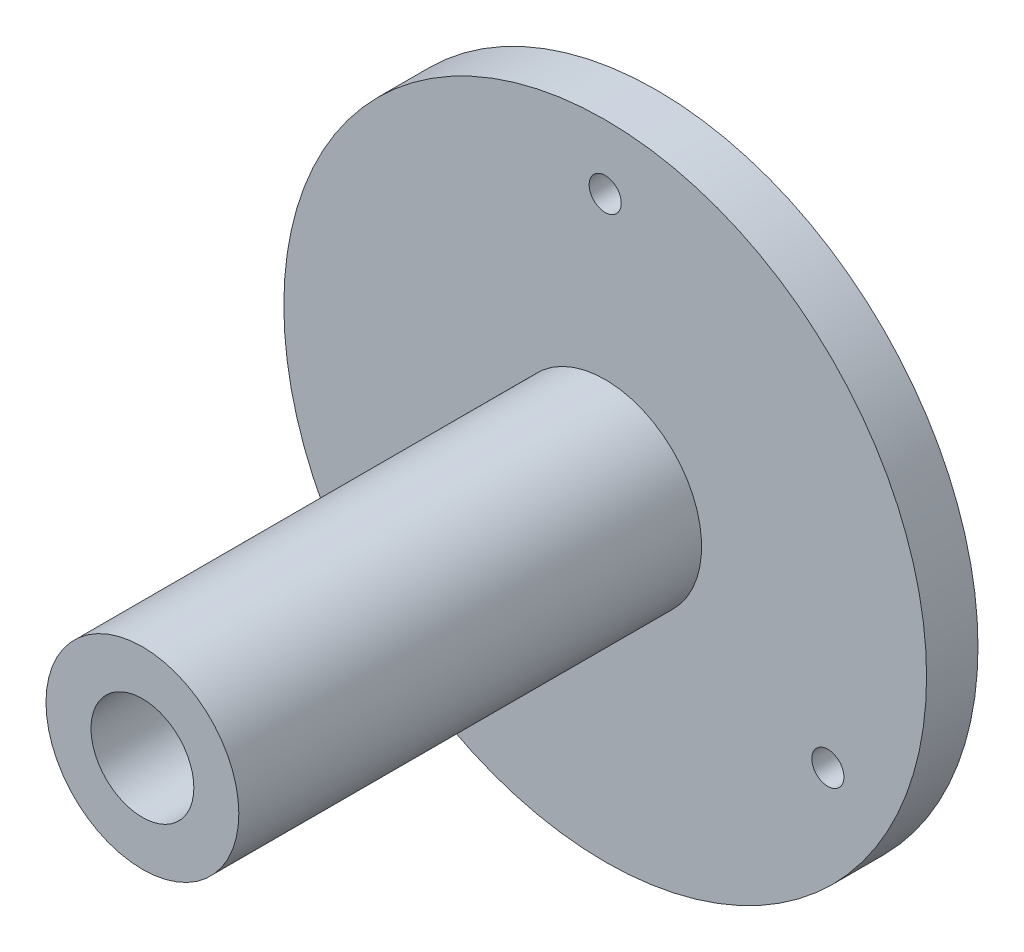
ISO-10303-21;
HEADER;
FILE_DESCRIPTION(('STEP AP214'),'2;1');
FILE_NAME('part.step','',(''),(''),'','','');
FILE_SCHEMA(('AUTOMOTIVE_DESIGN { 1 0 10303 214 1 1 1 1 }'));
ENDSEC;
DATA;
#1=APPLICATION_CONTEXT('core data for automotive mechanical design processes');
#2=APPLICATION_PROTOCOL_DEFINITION('international standard','automotive_design',2000,#1);
#3=PRODUCT_CONTEXT('',#1,'mechanical');
#4=PRODUCT('Part','Part','',(#3));
#5=PRODUCT_RELATED_PRODUCT_CATEGORY('part','',(#4));
#6=PRODUCT_DEFINITION_FORMATION('','',#4);
#7=PRODUCT_DEFINITION_CONTEXT('part definition',#1,'design');
#8=PRODUCT_DEFINITION('design','',#6,#7);
#9=PRODUCT_DEFINITION_SHAPE('','',#8);
#10=(LENGTH_UNIT() NAMED_UNIT(*) SI_UNIT(.MILLI.,.METRE.));
#11=(NAMED_UNIT(*) PLANE_ANGLE_UNIT() SI_UNIT($,.RADIAN.));
#12=(NAMED_UNIT(*) SI_UNIT($,.STERADIAN.) SOLID_ANGLE_UNIT());
#13=UNCERTAINTY_MEASURE_WITH_UNIT(LENGTH_MEASURE(1.E-05),#10,'distance_accuracy_value','');
#14=(GEOMETRIC_REPRESENTATION_CONTEXT(3) GLOBAL_UNCERTAINTY_ASSIGNED_CONTEXT((#13)) GLOBAL_UNIT_ASSIGNED_CONTEXT((#10,
#11,#12)) REPRESENTATION_CONTEXT('',''));
#15=CARTESIAN_POINT('',(0.,0.,0.));
#16=DIRECTION('',(0.,0.,1.));
#17=DIRECTION('',(1.,0.,0.));
#18=AXIS2_PLACEMENT_3D('',#15,#16,#17);
#19=CARTESIAN_POINT('',(0.,0.,90.));
#20=DIRECTION('',(0.,0.,-1.));
#21=DIRECTION('',(-1.,0.,0.));
#22=AXIS2_PLACEMENT_3D('',#19,#20,#21);
#23=CYLINDRICAL_SURFACE('',#22,15.);
#24=CARTESIAN_POINT('',(0.,0.,90.));
#25=DIRECTION('',(0.,0.,1.));
#26=DIRECTION('',(1.,0.,0.));
#27=AXIS2_PLACEMENT_3D('',#24,#25,#26);
#28=CIRCLE('',#27,15.);
#29=CARTESIAN_POINT('',(15.,0.,90.));
#30=VERTEX_POINT('',#29);
#31=EDGE_CURVE('E35',#30,#30,#28,.T.);
#32=ORIENTED_EDGE('',*,*,#31,.F.);
#33=EDGE_LOOP('',(#32));
#34=FACE_BOUND('',#33,.T.);
#35=CARTESIAN_POINT('',(0.,0.,18.));
#36=DIRECTION('',(0.,0.,-1.));
#37=DIRECTION('',(-1.,0.,0.));
#38=AXIS2_PLACEMENT_3D('',#35,#36,#37);
#39=CIRCLE('',#38,15.);
#40=CARTESIAN_POINT('',(-15.,0.,18.));
#41=VERTEX_POINT('',#40);
#42=EDGE_CURVE('E10',#41,#41,#39,.T.);
#43=ORIENTED_EDGE('',*,*,#42,.F.);
#44=EDGE_LOOP('',(#43));
#45=FACE_BOUND('',#44,.T.);
#46=ADVANCED_FACE('F29',(#34,#45),#23,.T.);
#47=CARTESIAN_POINT('',(0.,0.,90.));
#48=DIRECTION('',(0.,0.,1.));
#49=DIRECTION('',(1.,0.,0.));
#50=AXIS2_PLACEMENT_3D('',#47,#48,#49);
#51=PLANE('',#50);
#52=ORIENTED_EDGE('',*,*,#31,.T.);
#53=EDGE_LOOP('',(#52));
#54=FACE_BOUND('',#53,.T.);
#55=CARTESIAN_POINT('',(0.,0.,90.));
#56=DIRECTION('',(0.,0.,1.));
#57=DIRECTION('',(1.,0.,0.));
#58=AXIS2_PLACEMENT_3D('',#55,#56,#57);
#59=CIRCLE('',#58,8.);
#60=CARTESIAN_POINT('',(8.,0.,90.));
#61=VERTEX_POINT('',#60);
#62=EDGE_CURVE('E39',#61,#61,#59,.T.);
#63=ORIENTED_EDGE('',*,*,#62,.F.);
#64=EDGE_LOOP('',(#63));
#65=FACE_BOUND('',#64,.T.);
#66=ADVANCED_FACE('F103',(#54,#65),#51,.T.);
#67=CARTESIAN_POINT('',(0.,0.,9.99999999999999));
#68=DIRECTION('',(0.,0.,1.));
#69=DIRECTION('',(1.,0.,0.));
#70=AXIS2_PLACEMENT_3D('',#67,#68,#69);
#71=PLANE('',#70);
#72=CARTESIAN_POINT('',(-34.6410161513777,-19.9999999999997,9.99999999999999));
#73=DIRECTION('',(0.,0.,1.));
#74=DIRECTION('',(-0.499999999999992,0.866025403784443,0.));
#75=AXIS2_PLACEMENT_3D('',#72,#73,#74);
#76=CIRCLE('',#75,2.5);
#77=CARTESIAN_POINT('',(-35.8910161513777,-17.8349364905386,9.99999999999999));
#78=VERTEX_POINT('',#77);
#79=EDGE_CURVE('E64',#78,#78,#76,.T.);
#80=ORIENTED_EDGE('',*,*,#79,.T.);
#81=EDGE_LOOP('',(#80));
#82=FACE_BOUND('',#81,.T.);
#83=CARTESIAN_POINT('',(34.6410161513775,-20.0000000000002,9.99999999999999));
#84=DIRECTION('',(0.,0.,1.));
#85=DIRECTION('',(-0.500000000000004,-0.866025403784436,0.));
#86=AXIS2_PLACEMENT_3D('',#83,#84,#85);
#87=CIRCLE('',#86,2.5);
#88=CARTESIAN_POINT('',(33.3910161513775,-22.1650635094613,9.99999999999999));
#89=VERTEX_POINT('',#88);
#90=EDGE_CURVE('E58',#89,#89,#87,.T.);
#91=ORIENTED_EDGE('',*,*,#90,.T.);
#92=EDGE_LOOP('',(#91));
#93=FACE_BOUND('',#92,.T.);
#94=CARTESIAN_POINT('',(0.,40.,9.99999999999999));
#95=DIRECTION('',(0.,0.,1.));
#96=DIRECTION('',(1.,0.,0.));
#97=AXIS2_PLACEMENT_3D('',#94,#95,#96);
#98=CIRCLE('',#97,2.5);
#99=CARTESIAN_POINT('',(2.5,40.,9.99999999999999));
#100=VERTEX_POINT('',#99);
#101=EDGE_CURVE('E52',#100,#100,#98,.T.);
#102=ORIENTED_EDGE('',*,*,#101,.T.);
#103=EDGE_LOOP('',(#102));
#104=FACE_BOUND('',#103,.T.);
#105=CARTESIAN_POINT('',(0.,0.,9.99999999999999));
#106=DIRECTION('',(0.,0.,-1.));
#107=DIRECTION('',(-1.,0.,0.));
#108=AXIS2_PLACEMENT_3D('',#105,#106,#107);
#109=CIRCLE('',#108,50.);
#110=CARTESIAN_POINT('',(-50.,0.,9.99999999999999));
#111=VERTEX_POINT('',#110);
#112=EDGE_CURVE('E49',#111,#111,#109,.T.);
#113=ORIENTED_EDGE('',*,*,#112,.T.);
#114=EDGE_LOOP('',(#113));
#115=FACE_BOUND('',#114,.T.);
#116=CARTESIAN_POINT('',(0.,0.,9.99999999999999));
#117=DIRECTION('',(0.,0.,1.));
#118=DIRECTION('',(1.,0.,0.));
#119=AXIS2_PLACEMENT_3D('',#116,#117,#118);
#120=CIRCLE('',#119,8.);
#121=CARTESIAN_POINT('',(8.,0.,9.99999999999999));
#122=VERTEX_POINT('',#121);
#123=EDGE_CURVE('E43',#122,#122,#120,.T.);
#124=ORIENTED_EDGE('',*,*,#123,.T.);
#125=EDGE_LOOP('',(#124));
#126=FACE_BOUND('',#125,.T.);
#127=ADVANCED_FACE('F73',(#82,#93,#104,#115,#126),#71,.F.);
#128=CARTESIAN_POINT('',(0.,0.,90.));
#129=DIRECTION('',(0.,0.,-1.));
#130=DIRECTION('',(-1.,0.,0.));
#131=AXIS2_PLACEMENT_3D('',#128,#129,#130);
#132=CYLINDRICAL_SURFACE('',#131,8.);
#133=ORIENTED_EDGE('',*,*,#62,.T.);
#134=EDGE_LOOP('',(#133));
#135=FACE_BOUND('',#134,.T.);
#136=ORIENTED_EDGE('',*,*,#123,.F.);
#137=EDGE_LOOP('',(#136));
#138=FACE_BOUND('',#137,.T.);
#139=ADVANCED_FACE('F87',(#135,#138),#132,.F.);
#140=CARTESIAN_POINT('',(0.,0.,18.));
#141=DIRECTION('',(0.,0.,-1.));
#142=DIRECTION('',(-1.,0.,0.));
#143=AXIS2_PLACEMENT_3D('',#140,#141,#142);
#144=PLANE('',#143);
#145=CARTESIAN_POINT('',(-34.6410161513777,-19.9999999999997,18.));
#146=DIRECTION('',(0.,0.,1.));
#147=DIRECTION('',(-0.499999999999992,0.866025403784443,0.));
#148=AXIS2_PLACEMENT_3D('',#145,#146,#147);
#149=CIRCLE('',#148,2.5);
#150=CARTESIAN_POINT('',(-35.8910161513777,-17.8349364905386,18.));
#151=VERTEX_POINT('',#150);
#152=EDGE_CURVE('E67',#151,#151,#149,.T.);
#153=ORIENTED_EDGE('',*,*,#152,.F.);
#154=EDGE_LOOP('',(#153));
#155=FACE_BOUND('',#154,.T.);
#156=CARTESIAN_POINT('',(34.6410161513775,-20.0000000000002,18.));
#157=DIRECTION('',(0.,0.,1.));
#158=DIRECTION('',(-0.500000000000004,-0.866025403784436,0.));
#159=AXIS2_PLACEMENT_3D('',#156,#157,#158);
#160=CIRCLE('',#159,2.5);
#161=CARTESIAN_POINT('',(33.3910161513775,-22.1650635094613,18.));
#162=VERTEX_POINT('',#161);
#163=EDGE_CURVE('E61',#162,#162,#160,.T.);
#164=ORIENTED_EDGE('',*,*,#163,.F.);
#165=EDGE_LOOP('',(#164));
#166=FACE_BOUND('',#165,.T.);
#167=CARTESIAN_POINT('',(0.,40.,18.));
#168=DIRECTION('',(0.,0.,1.));
#169=DIRECTION('',(1.,0.,0.));
#170=AXIS2_PLACEMENT_3D('',#167,#168,#169);
#171=CIRCLE('',#170,2.5);
#172=CARTESIAN_POINT('',(2.5,40.,18.));
#173=VERTEX_POINT('',#172);
#174=EDGE_CURVE('E55',#173,#173,#171,.T.);
#175=ORIENTED_EDGE('',*,*,#174,.F.);
#176=EDGE_LOOP('',(#175));
#177=FACE_BOUND('',#176,.T.);
#178=CARTESIAN_POINT('',(0.,0.,18.));
#179=DIRECTION('',(0.,0.,-1.));
#180=DIRECTION('',(-1.,0.,0.));
#181=AXIS2_PLACEMENT_3D('',#178,#179,#180);
#182=CIRCLE('',#181,50.);
#183=CARTESIAN_POINT('',(-50.,0.,18.));
#184=VERTEX_POINT('',#183);
#185=EDGE_CURVE('E47',#184,#184,#182,.T.);
#186=ORIENTED_EDGE('',*,*,#185,.F.);
#187=EDGE_LOOP('',(#186));
#188=FACE_BOUND('',#187,.T.);
#189=ORIENTED_EDGE('',*,*,#42,.T.);
#190=EDGE_LOOP('',(#189));
#191=FACE_BOUND('',#190,.T.);
#192=ADVANCED_FACE('F83',(#155,#166,#177,#188,#191),#144,.F.);
#193=CARTESIAN_POINT('',(0.,0.,18.));
#194=DIRECTION('',(0.,0.,-1.));
#195=DIRECTION('',(-1.,0.,0.));
#196=AXIS2_PLACEMENT_3D('',#193,#194,#195);
#197=CYLINDRICAL_SURFACE('',#196,50.);
#198=ORIENTED_EDGE('',*,*,#185,.T.);
#199=EDGE_LOOP('',(#198));
#200=FACE_BOUND('',#199,.T.);
#201=ORIENTED_EDGE('',*,*,#112,.F.);
#202=EDGE_LOOP('',(#201));
#203=FACE_BOUND('',#202,.T.);
#204=ADVANCED_FACE('F86',(#200,#203),#197,.T.);
#205=CARTESIAN_POINT('',(0.,40.,9.99999999999999));
#206=DIRECTION('',(0.,0.,1.));
#207=DIRECTION('',(1.,0.,0.));
#208=AXIS2_PLACEMENT_3D('',#205,#206,#207);
#209=CYLINDRICAL_SURFACE('',#208,2.5);
#210=ORIENTED_EDGE('',*,*,#101,.F.);
#211=EDGE_LOOP('',(#210));
#212=FACE_BOUND('',#211,.T.);
#213=ORIENTED_EDGE('',*,*,#174,.T.);
#214=EDGE_LOOP('',(#213));
#215=FACE_BOUND('',#214,.T.);
#216=ADVANCED_FACE('F97',(#212,#215),#209,.F.);
#217=CARTESIAN_POINT('',(34.6410161513775,-20.0000000000002,9.99999999999999));
#218=DIRECTION('',(0.,0.,1.));
#219=DIRECTION('',(1.,0.,0.));
#220=AXIS2_PLACEMENT_3D('',#217,#218,#219);
#221=CYLINDRICAL_SURFACE('',#220,2.5);
#222=ORIENTED_EDGE('',*,*,#90,.F.);
#223=EDGE_LOOP('',(#222));
#224=FACE_BOUND('',#223,.T.);
#225=ORIENTED_EDGE('',*,*,#163,.T.);
#226=EDGE_LOOP('',(#225));
#227=FACE_BOUND('',#226,.T.);
#228=ADVANCED_FACE('F79',(#224,#227),#221,.F.);
#229=CARTESIAN_POINT('',(-34.6410161513777,-19.9999999999997,9.99999999999999));
#230=DIRECTION('',(0.,0.,1.));
#231=DIRECTION('',(1.,0.,0.));
#232=AXIS2_PLACEMENT_3D('',#229,#230,#231);
#233=CYLINDRICAL_SURFACE('',#232,2.5);
#234=ORIENTED_EDGE('',*,*,#79,.F.);
#235=EDGE_LOOP('',(#234));
#236=FACE_BOUND('',#235,.T.);
#237=ORIENTED_EDGE('',*,*,#152,.T.);
#238=EDGE_LOOP('',(#237));
#239=FACE_BOUND('',#238,.T.);
#240=ADVANCED_FACE('F76',(#236,#239),#233,.F.);
#241=CLOSED_SHELL('',(#46,#66,#127,#139,#192,#204,#216,#228,#240));
#242=MANIFOLD_SOLID_BREP('B2',#241);
#243=ADVANCED_BREP_SHAPE_REPRESENTATION('',(#18,#242),#14);
#244=SHAPE_DEFINITION_REPRESENTATION(#9,#243);
ENDSEC;
END-ISO-10303-21;
